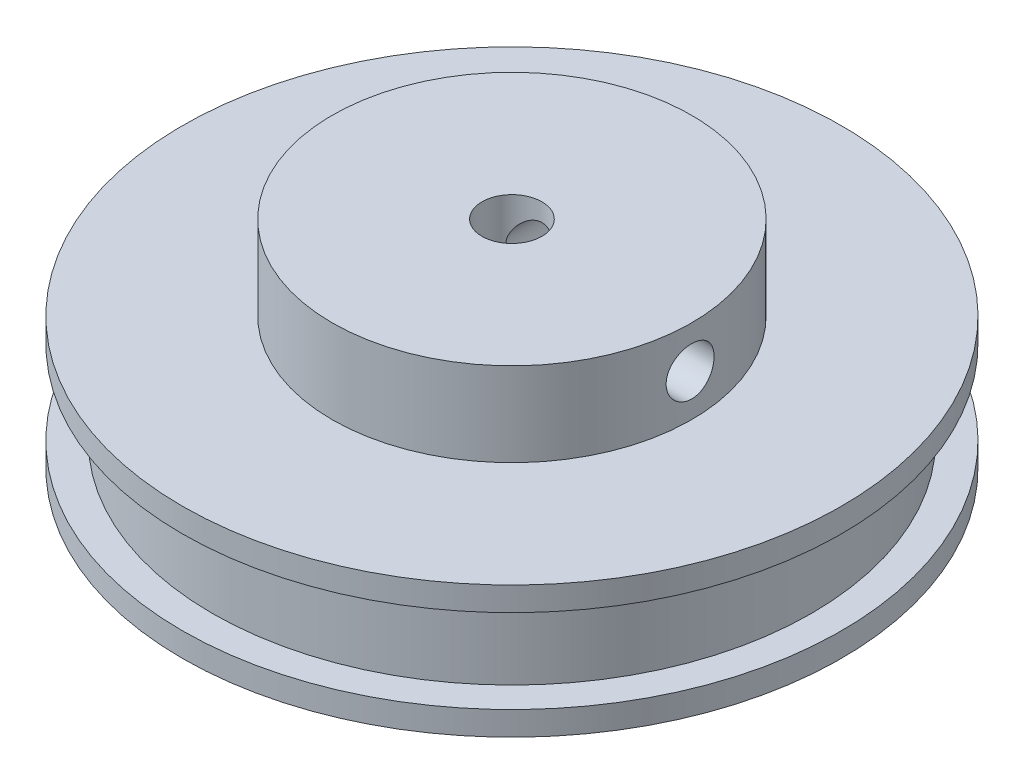
ISO-10303-21;
HEADER;
FILE_DESCRIPTION(('STEP AP214'),'2;1');
FILE_NAME('part.step','',(''),(''),'','','');
FILE_SCHEMA(('AUTOMOTIVE_DESIGN { 1 0 10303 214 1 1 1 1 }'));
ENDSEC;
DATA;
#1=APPLICATION_CONTEXT('core data for automotive mechanical design processes');
#2=APPLICATION_PROTOCOL_DEFINITION('international standard','automotive_design',2000,#1);
#3=PRODUCT_CONTEXT('',#1,'mechanical');
#4=PRODUCT('Part','Part','',(#3));
#5=PRODUCT_RELATED_PRODUCT_CATEGORY('part','',(#4));
#6=PRODUCT_DEFINITION_FORMATION('','',#4);
#7=PRODUCT_DEFINITION_CONTEXT('part definition',#1,'design');
#8=PRODUCT_DEFINITION('design','',#6,#7);
#9=PRODUCT_DEFINITION_SHAPE('','',#8);
#10=(LENGTH_UNIT() NAMED_UNIT(*) SI_UNIT(.MILLI.,.METRE.));
#11=(NAMED_UNIT(*) PLANE_ANGLE_UNIT() SI_UNIT($,.RADIAN.));
#12=(NAMED_UNIT(*) SI_UNIT($,.STERADIAN.) SOLID_ANGLE_UNIT());
#13=UNCERTAINTY_MEASURE_WITH_UNIT(LENGTH_MEASURE(1.E-05),#10,'distance_accuracy_value','');
#14=(GEOMETRIC_REPRESENTATION_CONTEXT(3) GLOBAL_UNCERTAINTY_ASSIGNED_CONTEXT((#13)) GLOBAL_UNIT_ASSIGNED_CONTEXT((#10,
#11,#12)) REPRESENTATION_CONTEXT('',''));
#15=CARTESIAN_POINT('',(0.,0.,0.));
#16=DIRECTION('',(0.,0.,1.));
#17=DIRECTION('',(1.,0.,0.));
#18=AXIS2_PLACEMENT_3D('',#15,#16,#17);
#19=CARTESIAN_POINT('',(0.,2.,0.));
#20=DIRECTION('',(0.,-1.,0.));
#21=DIRECTION('',(0.,0.,-1.));
#22=AXIS2_PLACEMENT_3D('',#19,#20,#21);
#23=CYLINDRICAL_SURFACE('',#22,27.5);
#24=CARTESIAN_POINT('',(0.,2.,0.));
#25=DIRECTION('',(0.,1.,0.));
#26=DIRECTION('',(0.,0.,1.));
#27=AXIS2_PLACEMENT_3D('',#24,#25,#26);
#28=CIRCLE('',#27,27.5);
#29=CARTESIAN_POINT('',(0.,2.,27.5));
#30=VERTEX_POINT('',#29);
#31=EDGE_CURVE('E136',#30,#30,#28,.T.);
#32=ORIENTED_EDGE('',*,*,#31,.F.);
#33=EDGE_LOOP('',(#32));
#34=FACE_BOUND('',#33,.T.);
#35=CARTESIAN_POINT('',(0.,0.,0.));
#36=DIRECTION('',(0.,1.,0.));
#37=DIRECTION('',(0.,0.,1.));
#38=AXIS2_PLACEMENT_3D('',#35,#36,#37);
#39=CIRCLE('',#38,27.5);
#40=CARTESIAN_POINT('',(0.,0.,27.5));
#41=VERTEX_POINT('',#40);
#42=EDGE_CURVE('E77',#41,#41,#39,.T.);
#43=ORIENTED_EDGE('',*,*,#42,.T.);
#44=EDGE_LOOP('',(#43));
#45=FACE_BOUND('',#44,.T.);
#46=ADVANCED_FACE('F38',(#34,#45),#23,.T.);
#47=CARTESIAN_POINT('',(0.,2.,0.));
#48=DIRECTION('',(0.,1.,0.));
#49=DIRECTION('',(0.,0.,1.));
#50=AXIS2_PLACEMENT_3D('',#47,#48,#49);
#51=PLANE('',#50);
#52=CARTESIAN_POINT('',(0.,2.,0.));
#53=DIRECTION('',(0.,1.,0.));
#54=DIRECTION('',(0.,0.,1.));
#55=AXIS2_PLACEMENT_3D('',#52,#53,#54);
#56=CIRCLE('',#55,25.);
#57=CARTESIAN_POINT('',(0.,2.,25.));
#58=VERTEX_POINT('',#57);
#59=EDGE_CURVE('E140',#58,#58,#56,.T.);
#60=ORIENTED_EDGE('',*,*,#59,.F.);
#61=EDGE_LOOP('',(#60));
#62=FACE_BOUND('',#61,.T.);
#63=ORIENTED_EDGE('',*,*,#31,.T.);
#64=EDGE_LOOP('',(#63));
#65=FACE_BOUND('',#64,.T.);
#66=ADVANCED_FACE('F120',(#62,#65),#51,.T.);
#67=CARTESIAN_POINT('',(0.,0.,0.));
#68=DIRECTION('',(0.,1.,0.));
#69=DIRECTION('',(0.,0.,1.));
#70=AXIS2_PLACEMENT_3D('',#67,#68,#69);
#71=PLANE('',#70);
#72=CARTESIAN_POINT('',(0.,0.,0.));
#73=DIRECTION('',(0.,1.,0.));
#74=DIRECTION('',(0.,0.,1.));
#75=AXIS2_PLACEMENT_3D('',#72,#73,#74);
#76=CIRCLE('',#75,2.5);
#77=CARTESIAN_POINT('',(0.,0.,2.5));
#78=VERTEX_POINT('',#77);
#79=EDGE_CURVE('E94',#78,#78,#76,.T.);
#80=ORIENTED_EDGE('',*,*,#79,.T.);
#81=EDGE_LOOP('',(#80));
#82=FACE_BOUND('',#81,.T.);
#83=ORIENTED_EDGE('',*,*,#42,.F.);
#84=EDGE_LOOP('',(#83));
#85=FACE_BOUND('',#84,.T.);
#86=ADVANCED_FACE('F118',(#82,#85),#71,.F.);
#87=CARTESIAN_POINT('',(0.,9.,0.));
#88=DIRECTION('',(0.,-1.,0.));
#89=DIRECTION('',(0.,0.,-1.));
#90=AXIS2_PLACEMENT_3D('',#87,#88,#89);
#91=CYLINDRICAL_SURFACE('',#90,25.);
#92=CARTESIAN_POINT('',(0.,9.,0.));
#93=DIRECTION('',(0.,1.,0.));
#94=DIRECTION('',(0.,0.,1.));
#95=AXIS2_PLACEMENT_3D('',#92,#93,#94);
#96=CIRCLE('',#95,25.);
#97=CARTESIAN_POINT('',(0.,9.,25.));
#98=VERTEX_POINT('',#97);
#99=EDGE_CURVE('E139',#98,#98,#96,.T.);
#100=ORIENTED_EDGE('',*,*,#99,.F.);
#101=EDGE_LOOP('',(#100));
#102=FACE_BOUND('',#101,.T.);
#103=ORIENTED_EDGE('',*,*,#59,.T.);
#104=EDGE_LOOP('',(#103));
#105=FACE_BOUND('',#104,.T.);
#106=ADVANCED_FACE('F114',(#102,#105),#91,.T.);
#107=CARTESIAN_POINT('',(0.,11.,0.));
#108=DIRECTION('',(0.,-1.,0.));
#109=DIRECTION('',(0.,0.,-1.));
#110=AXIS2_PLACEMENT_3D('',#107,#108,#109);
#111=CYLINDRICAL_SURFACE('',#110,27.5);
#112=CARTESIAN_POINT('',(0.,11.,0.));
#113=DIRECTION('',(0.,1.,0.));
#114=DIRECTION('',(0.,0.,1.));
#115=AXIS2_PLACEMENT_3D('',#112,#113,#114);
#116=CIRCLE('',#115,27.5);
#117=CARTESIAN_POINT('',(0.,11.,27.5));
#118=VERTEX_POINT('',#117);
#119=EDGE_CURVE('E142',#118,#118,#116,.T.);
#120=ORIENTED_EDGE('',*,*,#119,.F.);
#121=EDGE_LOOP('',(#120));
#122=FACE_BOUND('',#121,.T.);
#123=CARTESIAN_POINT('',(0.,9.,0.));
#124=DIRECTION('',(0.,1.,0.));
#125=DIRECTION('',(0.,0.,1.));
#126=AXIS2_PLACEMENT_3D('',#123,#124,#125);
#127=CIRCLE('',#126,27.5);
#128=CARTESIAN_POINT('',(0.,9.,27.5));
#129=VERTEX_POINT('',#128);
#130=EDGE_CURVE('E146',#129,#129,#127,.T.);
#131=ORIENTED_EDGE('',*,*,#130,.T.);
#132=EDGE_LOOP('',(#131));
#133=FACE_BOUND('',#132,.T.);
#134=ADVANCED_FACE('F107',(#122,#133),#111,.T.);
#135=CARTESIAN_POINT('',(0.,11.,0.));
#136=DIRECTION('',(0.,1.,0.));
#137=DIRECTION('',(0.,0.,1.));
#138=AXIS2_PLACEMENT_3D('',#135,#136,#137);
#139=PLANE('',#138);
#140=CARTESIAN_POINT('',(0.,11.,0.));
#141=DIRECTION('',(0.,1.,0.));
#142=DIRECTION('',(0.,0.,1.));
#143=AXIS2_PLACEMENT_3D('',#140,#141,#142);
#144=CIRCLE('',#143,15.);
#145=CARTESIAN_POINT('',(0.,11.,15.));
#146=VERTEX_POINT('',#145);
#147=EDGE_CURVE('E45',#146,#146,#144,.T.);
#148=ORIENTED_EDGE('',*,*,#147,.F.);
#149=EDGE_LOOP('',(#148));
#150=FACE_BOUND('',#149,.T.);
#151=ORIENTED_EDGE('',*,*,#119,.T.);
#152=EDGE_LOOP('',(#151));
#153=FACE_BOUND('',#152,.T.);
#154=ADVANCED_FACE('F103',(#150,#153),#139,.T.);
#155=CARTESIAN_POINT('',(0.,9.,0.));
#156=DIRECTION('',(0.,1.,0.));
#157=DIRECTION('',(0.,0.,1.));
#158=AXIS2_PLACEMENT_3D('',#155,#156,#157);
#159=PLANE('',#158);
#160=ORIENTED_EDGE('',*,*,#99,.T.);
#161=EDGE_LOOP('',(#160));
#162=FACE_BOUND('',#161,.T.);
#163=ORIENTED_EDGE('',*,*,#130,.F.);
#164=EDGE_LOOP('',(#163));
#165=FACE_BOUND('',#164,.T.);
#166=ADVANCED_FACE('F101',(#162,#165),#159,.F.);
#167=CARTESIAN_POINT('',(0.,18.,0.));
#168=DIRECTION('',(0.,-1.,0.));
#169=DIRECTION('',(0.,0.,-1.));
#170=AXIS2_PLACEMENT_3D('',#167,#168,#169);
#171=CYLINDRICAL_SURFACE('',#170,15.);
#172=CARTESIAN_POINT('',(14.8660687473185,14.5,2.00000000000005));
#173=CARTESIAN_POINT('',(14.8660704451043,14.6118038554675,1.99999528594764));
#174=CARTESIAN_POINT('',(14.8673436464034,14.7236760331162,1.99059326704133));
#175=CARTESIAN_POINT('',(14.8722964859732,14.9443024623359,1.95323796266135));
#176=CARTESIAN_POINT('',(14.8759785863295,15.0530534049172,1.92526569649118));
#177=CARTESIAN_POINT('',(14.8853249214529,15.2642113682263,1.85161311140269));
#178=CARTESIAN_POINT('',(14.8909877556206,15.3666228116177,1.8059453027505));
#179=CARTESIAN_POINT('',(14.9036558225185,15.5623110757096,1.69822564880692));
#180=CARTESIAN_POINT('',(14.9106608397868,15.655589358938,1.63617643263474));
#181=CARTESIAN_POINT('',(14.9252737732073,15.8309734546685,1.49703370489523));
#182=CARTESIAN_POINT('',(14.9328848849373,15.9130128656794,1.41985682274865));
#183=CARTESIAN_POINT('',(14.9478237625824,16.0630162454564,1.25282922872616));
#184=CARTESIAN_POINT('',(14.9551515139324,16.1309794914762,1.16297786647204));
#185=CARTESIAN_POINT('',(14.9687309976037,16.2511418417164,0.972731724927666));
#186=CARTESIAN_POINT('',(14.9749785650228,16.3032804892902,0.872298437711275));
#187=CARTESIAN_POINT('',(14.9856585341581,16.3899261641808,0.66400381603742));
#188=CARTESIAN_POINT('',(14.990091012146,16.4244339323777,0.556142793922454));
#189=CARTESIAN_POINT('',(14.9966188619561,16.4746389095803,0.336735375014143));
#190=CARTESIAN_POINT('',(14.9987279820508,16.490446815012,0.225214723469952));
#191=CARTESIAN_POINT('',(15.0004184797152,16.5031466087368,0.00108500230371052));
#192=CARTESIAN_POINT('',(14.9999999696283,16.5000393377365,-0.111524018722412));
#193=CARTESIAN_POINT('',(14.9966934411691,16.4750852694591,-0.333880124465715));
#194=CARTESIAN_POINT('',(14.9938211133781,16.4533575352544,-0.44364083736173));
#195=CARTESIAN_POINT('',(14.9859472409229,16.3919656729785,-0.6579441227125));
#196=CARTESIAN_POINT('',(14.9809456511403,16.3523011648319,-0.762486584541785));
#197=CARTESIAN_POINT('',(14.9693481900417,16.2560365588782,-0.963751808424073));
#198=CARTESIAN_POINT('',(14.9627475214588,16.1993853768169,-1.0604498493532));
#199=CARTESIAN_POINT('',(14.9486895041904,16.0707927427171,-1.24301169073473));
#200=CARTESIAN_POINT('',(14.9412321108429,15.9988504933722,-1.32887492586676));
#201=CARTESIAN_POINT('',(14.9262258809566,15.8410521516411,-1.48803006154533));
#202=CARTESIAN_POINT('',(14.918676784244,15.7550922318064,-1.56121903353016));
#203=CARTESIAN_POINT('',(14.9043949876924,15.5720540686274,-1.69214693057186));
#204=CARTESIAN_POINT('',(14.8976622910908,15.474975781197,-1.74988579436348));
#205=CARTESIAN_POINT('',(14.8857757633434,15.2723599996533,-1.84828286086495));
#206=CARTESIAN_POINT('',(14.8806227621479,15.1668180954815,-1.88893208906701));
#207=CARTESIAN_POINT('',(14.8724947546572,14.9503219793616,-1.95190090044919));
#208=CARTESIAN_POINT('',(14.8695196283616,14.8393680659734,-1.97422149354138));
#209=CARTESIAN_POINT('',(14.8661064501035,14.616108664995,-1.99976160768722));
#210=CARTESIAN_POINT('',(14.8656491151163,14.5038200696675,-2.00312631098807));
#211=CARTESIAN_POINT('',(14.867272242967,14.2802807438953,-1.99104288188791));
#212=CARTESIAN_POINT('',(14.8693526440475,14.1690299882606,-1.97559520729771));
#213=CARTESIAN_POINT('',(14.8757992043677,13.9511640135944,-1.92644805037015));
#214=CARTESIAN_POINT('',(14.8801564778765,13.8445325069819,-1.89281950323355));
#215=CARTESIAN_POINT('',(14.8906585901441,13.6384210865476,-1.8083384508012));
#216=CARTESIAN_POINT('',(14.8968034998284,13.5389414566763,-1.75748526209378));
#217=CARTESIAN_POINT('',(14.9102344661952,13.3493026895592,-1.63964406417206));
#218=CARTESIAN_POINT('',(14.9175271378913,13.2592029516318,-1.57256123166295));
#219=CARTESIAN_POINT('',(14.9324114351651,13.0914890615629,-1.42429832312794));
#220=CARTESIAN_POINT('',(14.9400030739993,13.013875463852,-1.34311762143749));
#221=CARTESIAN_POINT('',(14.9546894865533,12.8728234460789,-1.16832754835819));
#222=CARTESIAN_POINT('',(14.9617807004972,12.8094806836284,-1.07464064093247));
#223=CARTESIAN_POINT('',(14.974613414783,12.6994317178247,-0.87787245231757));
#224=CARTESIAN_POINT('',(14.9803549454849,12.6527251402439,-0.774791382513649));
#225=CARTESIAN_POINT('',(14.9898256469115,12.5774307384119,-0.562472772523383));
#226=CARTESIAN_POINT('',(14.9935608482078,12.5487885709165,-0.453254784247312));
#227=CARTESIAN_POINT('',(14.9986231668662,12.510259514539,-0.231506493423148));
#228=CARTESIAN_POINT('',(14.9999504085613,12.5003716572923,-0.118976362199773));
#229=CARTESIAN_POINT('',(15.0000464724842,12.4996517327597,0.105269873711638));
#230=CARTESIAN_POINT('',(14.9988350491343,12.5086725294056,0.21698552592193));
#231=CARTESIAN_POINT('',(14.9940293321986,12.545201041232,0.437297443052403));
#232=CARTESIAN_POINT('',(14.9904350419501,12.5727087305213,0.545893712341097));
#233=CARTESIAN_POINT('',(14.9812655664247,12.6453820470767,0.75685823458891));
#234=CARTESIAN_POINT('',(14.9756912840831,12.6905396264081,0.859229301543961));
#235=CARTESIAN_POINT('',(14.9631774939599,12.7972155496457,1.05496407863093));
#236=CARTESIAN_POINT('',(14.95623796097,12.8587341956524,1.14832762239922));
#237=CARTESIAN_POINT('',(14.9417029120984,12.9969266820036,1.32414728606679));
#238=CARTESIAN_POINT('',(14.9341029029987,13.0737097901392,1.40651715716405));
#239=CARTESIAN_POINT('',(14.919138648968,13.2400230690474,1.55725895587221));
#240=CARTESIAN_POINT('',(14.911774460102,13.3295562439213,1.62562757530237));
#241=CARTESIAN_POINT('',(14.8980810988492,13.5192839415709,1.746687909785));
#242=CARTESIAN_POINT('',(14.8917566176026,13.6195235915101,1.79930940429131));
#243=CARTESIAN_POINT('',(14.8809136658427,13.8274484675171,1.88689518281496));
#244=CARTESIAN_POINT('',(14.8763932602426,13.9351255697594,1.92187839666371));
#245=CARTESIAN_POINT('',(14.8707513382361,14.1194482787255,1.96495480378588));
#246=CARTESIAN_POINT('',(14.8690042861798,14.1949382729681,1.97807748135808));
#247=CARTESIAN_POINT('',(14.866662414787,14.3469415094705,1.99560165343187));
#248=CARTESIAN_POINT('',(14.8660675849485,14.4234547423974,2.00000322742325));
#249=CARTESIAN_POINT('',(14.8660687473185,14.5,2.00000000000005));
#250=B_SPLINE_CURVE_WITH_KNOTS('',3,(#172,#173,#174,#175,#176,#177,#178,#179,#180,#181,#182,
#183,#184,#185,#186,#187,#188,#189,#190,#191,#192,#193,#194,#195,#196,#197,#198,#199,#200,#201,
#202,#203,#204,#205,#206,#207,#208,#209,#210,#211,#212,#213,#214,#215,#216,#217,#218,#219,#220,
#221,#222,#223,#224,#225,#226,#227,#228,#229,#230,#231,#232,#233,#234,#235,#236,#237,#238,#239,
#240,#241,#242,#243,#244,#245,#246,#247,#248,#249),.UNSPECIFIED.,.T.,.F.,(4,2,2,2,2,2,2,2,2,2,2,
2,2,2,2,2,2,2,2,2,2,2,2,2,2,2,2,2,2,2,2,2,2,2,2,2,2,2,4),(0.,0.335131889250449,
0.670606846105682,1.00584506276825,1.34102950834956,1.67811595121165,2.01521969762238,
2.35359556525146,2.69195721256928,3.02830569524968,3.36463922864856,3.69883808669952,
4.03304402666678,4.36826528456251,4.70350402584628,5.04134915068958,5.3791956151909,
5.7172192765574,6.05522431149101,6.3906370258193,6.72604157783542,7.06014684818595,
7.39426537618209,7.73038528142332,8.06652010750621,8.40484511764504,8.74316251675152,
9.08045723770335,9.41773454222147,9.752397098563,10.0870591862064,10.4215688535019,
10.7560846978108,11.0930874236894,11.430169684094,11.768733419821,12.1069330231324,
12.3363794094425,12.5658237044201),.UNSPECIFIED.);
#251=CARTESIAN_POINT('',(14.8660687473185,14.5,2.00000000000005));
#252=VERTEX_POINT('',#251);
#253=EDGE_CURVE('E61',#252,#252,#250,.T.);
#254=ORIENTED_EDGE('',*,*,#253,.T.);
#255=EDGE_LOOP('',(#254));
#256=FACE_BOUND('',#255,.T.);
#257=CARTESIAN_POINT('',(0.,16.5,-15.));
#258=CARTESIAN_POINT('',(-0.111808835669284,16.4999952902931,-14.9999983574254));
#259=CARTESIAN_POINT('',(-0.22368597927628,16.4905924620375,-14.9987367072719));
#260=CARTESIAN_POINT('',(-0.444322725138079,16.4532336509504,-14.993825111269));
#261=CARTESIAN_POINT('',(-0.553079022333037,16.4252587051029,-14.9901727244172));
#262=CARTESIAN_POINT('',(-0.764248312626985,16.3515982824586,-14.9808907984907));
#263=CARTESIAN_POINT('',(-0.866665683058495,16.3059251889616,-14.9752626421097));
#264=CARTESIAN_POINT('',(-1.0623638950303,16.1981930861937,-14.9626538666039));
#265=CARTESIAN_POINT('',(-1.15564620633703,16.1361367188335,-14.9556734655857));
#266=CARTESIAN_POINT('',(-1.33102582250468,15.9969867383958,-14.9410899478996));
#267=CARTESIAN_POINT('',(-1.41305798549586,15.9198113549915,-14.9334835816211));
#268=CARTESIAN_POINT('',(-1.56304735673102,15.7527898109233,-14.9185313755795));
#269=CARTESIAN_POINT('',(-1.63100381997221,15.6629429800042,-14.9111855496234));
#270=CARTESIAN_POINT('',(-1.75115902268907,15.472700877055,-14.8975543544019));
#271=CARTESIAN_POINT('',(-1.80329607482578,15.3722663175214,-14.8912731776576));
#272=CARTESIAN_POINT('',(-1.8899384500729,15.1639689327632,-14.8805258737923));
#273=CARTESIAN_POINT('',(-1.92444453245278,15.0561064276467,-14.8760596685121));
#274=CARTESIAN_POINT('',(-1.97464606772174,14.8366941894983,-14.8694793656867));
#275=CARTESIAN_POINT('',(-1.99045204228506,14.7251701654671,-14.8673514537014));
#276=CARTESIAN_POINT('',(-2.00314680548117,14.501033820394,-14.8656465160931));
#277=CARTESIAN_POINT('',(-2.00003645633601,14.3884215491891,-14.866069374204));
#278=CARTESIAN_POINT('',(-1.97507745939234,14.1660788699721,-14.8694055577299));
#279=CARTESIAN_POINT('',(-1.95335097531762,14.0563344701143,-14.8723026462234));
#280=CARTESIAN_POINT('',(-1.89196724634371,13.8420631632399,-14.8802355277475));
#281=CARTESIAN_POINT('',(-1.85230959261457,13.737536375245,-14.8852713695413));
#282=CARTESIAN_POINT('',(-1.75605929143191,13.5362903652928,-14.8969326111103));
#283=CARTESIAN_POINT('',(-1.69941397913749,13.4395966288057,-14.903562941239));
#284=CARTESIAN_POINT('',(-1.57083393344289,13.2570409180823,-14.9176623621993));
#285=CARTESIAN_POINT('',(-1.49889840502385,13.1711795074458,-14.9251314966353));
#286=CARTESIAN_POINT('',(-1.34110490026362,13.0120169874181,-14.9401389923359));
#287=CARTESIAN_POINT('',(-1.25514170702645,12.9388201572977,-14.947677435412));
#288=CARTESIAN_POINT('',(-1.07209417013341,12.8078779550716,-14.9619192381826));
#289=CARTESIAN_POINT('',(-0.975009794442368,12.7501326274765,-14.9686225954715));
#290=CARTESIAN_POINT('',(-0.772392219730468,12.6517308823053,-14.9804439374358));
#291=CARTESIAN_POINT('',(-0.666855578841229,12.6110814689537,-14.9855612720896));
#292=CARTESIAN_POINT('',(-0.450370924336247,12.5481106810277,-14.9936282590407));
#293=CARTESIAN_POINT('',(-0.339423199542255,12.5257883293606,-14.9965780268993));
#294=CARTESIAN_POINT('',(-0.116166903325642,12.5002415672289,-14.9999624137686));
#295=CARTESIAN_POINT('',(-0.00387503454704105,12.4968735982165,-15.0004159384905));
#296=CARTESIAN_POINT('',(0.219671617218719,12.5089516641272,-14.9988079153852));
#297=CARTESIAN_POINT('',(0.330926425345666,12.5243972417824,-14.996746428686));
#298=CARTESIAN_POINT('',(0.548813715572939,12.573544653384,-14.990351753581));
#299=CARTESIAN_POINT('',(0.655462016512046,12.6071775683222,-14.9860271430292));
#300=CARTESIAN_POINT('',(0.86160509879356,12.6916729659371,-14.9755900925429));
#301=CARTESIAN_POINT('',(0.961099607015639,12.7425361060133,-14.9694775843944));
#302=CARTESIAN_POINT('',(1.15074887861608,12.8603921555833,-14.9560983737007));
#303=CARTESIAN_POINT('',(1.2408458143966,12.9274773657133,-14.9488251504572));
#304=CARTESIAN_POINT('',(1.4085529469919,13.0757433292243,-14.9339572870998));
#305=CARTESIAN_POINT('',(1.48616257662379,13.1569247225164,-14.9263626324062));
#306=CARTESIAN_POINT('',(1.62720549423098,13.3317131426396,-14.9116490247351));
#307=CARTESIAN_POINT('',(1.69054327608938,13.4253975667382,-14.904533487753));
#308=CARTESIAN_POINT('',(1.80058351078814,13.6221594102809,-14.8916413300182));
#309=CARTESIAN_POINT('',(1.84728633510347,13.7252366199104,-14.8858646793678));
#310=CARTESIAN_POINT('',(1.92257836500746,13.9375572420277,-14.8763281178008));
#311=CARTESIAN_POINT('',(1.95122028846796,14.0467816852108,-14.872562342326));
#312=CARTESIAN_POINT('',(1.98974667143959,14.2685436321288,-14.8674574869829));
#313=CARTESIAN_POINT('',(1.99963213426782,14.3810809583244,-14.8661182773134));
#314=CARTESIAN_POINT('',(2.00034485806189,14.6053234908535,-14.8660223129545));
#315=CARTESIAN_POINT('',(1.99132219194493,14.7170282409642,-14.8672452228252));
#316=CARTESIAN_POINT('',(1.95479376686689,14.9373178751039,-14.872091838742));
#317=CARTESIAN_POINT('',(1.92728801483269,15.045902760302,-14.8757155438883));
#318=CARTESIAN_POINT('',(1.85462310332207,15.2568436832516,-14.8849489027276));
#319=CARTESIAN_POINT('',(1.80947220819041,15.3592026111169,-14.890557626594));
#320=CARTESIAN_POINT('',(1.70281342759737,15.5549158838261,-14.9031304571282));
#321=CARTESIAN_POINT('',(1.64130522630428,15.648270054756,-14.910094589966));
#322=CARTESIAN_POINT('',(1.50312448509508,15.8240896499284,-14.9246596718306));
#323=CARTESIAN_POINT('',(1.42634027226901,15.9064669477551,-14.9322650575408));
#324=CARTESIAN_POINT('',(1.26002169349824,16.0572232163615,-14.9472171900166));
#325=CARTESIAN_POINT('',(1.17048434072978,16.1255988987503,-14.9545638756898));
#326=CARTESIAN_POINT('',(0.980752987852822,16.2466671384665,-14.9682063513753));
#327=CARTESIAN_POINT('',(0.880514620743964,16.2992906665552,-14.9744974642689));
#328=CARTESIAN_POINT('',(0.672592409587328,16.3868805985451,-14.9852732065897));
#329=CARTESIAN_POINT('',(0.564916678969889,16.4218659086249,-14.9897597692431));
#330=CARTESIAN_POINT('',(0.380588408098418,16.4649480063852,-14.9953572174327));
#331=CARTESIAN_POINT('',(0.305091081955778,16.4780732435236,-14.9970896363507));
#332=CARTESIAN_POINT('',(0.153073171616111,16.4956008141655,-14.9994115849077));
#333=CARTESIAN_POINT('',(0.0765525964512399,16.5000032246136,-15.000001124628));
#334=CARTESIAN_POINT('',(0.,16.5,-15.));
#335=B_SPLINE_CURVE_WITH_KNOTS('',3,(#257,#258,#259,#260,#261,#262,#263,#264,#265,#266,#267,
#268,#269,#270,#271,#272,#273,#274,#275,#276,#277,#278,#279,#280,#281,#282,#283,#284,#285,#286,
#287,#288,#289,#290,#291,#292,#293,#294,#295,#296,#297,#298,#299,#300,#301,#302,#303,#304,#305,
#306,#307,#308,#309,#310,#311,#312,#313,#314,#315,#316,#317,#318,#319,#320,#321,#322,#323,#324,
#325,#326,#327,#328,#329,#330,#331,#332,#333,#334),.UNSPECIFIED.,.T.,.F.,(4,2,2,2,2,2,2,2,2,2,2,
2,2,2,2,2,2,2,2,2,2,2,2,2,2,2,2,2,2,2,2,2,2,2,2,2,2,2,4),(0.,0.335146851305744,
0.670636430885045,1.00589169282741,1.34109292564035,1.67815978443559,2.01524447904836,
2.35362721511648,2.69199537766205,3.02835355914359,3.3646964092492,3.69884885098044,
4.03300891175851,4.36821583137898,4.70344018443797,5.04130544484849,5.37917167852296,
5.71717620202539,6.05516270391743,6.39058584992061,6.72600084354478,7.06015363396463,
7.39431917503546,7.73043274769884,8.06656158258761,8.4048770453545,8.74318495273048,
9.08050074735454,9.41779849783634,9.75242927496624,10.0870599266874,10.4215340370262,
10.756014605959,11.0930366783511,11.4301378125116,11.7686952667452,12.1068890499242,
12.3363573904731,12.5658237068544),.UNSPECIFIED.);
#336=CARTESIAN_POINT('',(0.,16.5,-15.));
#337=VERTEX_POINT('',#336);
#338=EDGE_CURVE('E65',#337,#337,#335,.T.);
#339=ORIENTED_EDGE('',*,*,#338,.T.);
#340=EDGE_LOOP('',(#339));
#341=FACE_BOUND('',#340,.T.);
#342=CARTESIAN_POINT('',(0.,18.,0.));
#343=DIRECTION('',(0.,1.,0.));
#344=DIRECTION('',(0.,0.,1.));
#345=AXIS2_PLACEMENT_3D('',#342,#343,#344);
#346=CIRCLE('',#345,15.);
#347=CARTESIAN_POINT('',(0.,18.,15.));
#348=VERTEX_POINT('',#347);
#349=EDGE_CURVE('E158',#348,#348,#346,.T.);
#350=ORIENTED_EDGE('',*,*,#349,.F.);
#351=EDGE_LOOP('',(#350));
#352=FACE_BOUND('',#351,.T.);
#353=ORIENTED_EDGE('',*,*,#147,.T.);
#354=EDGE_LOOP('',(#353));
#355=FACE_BOUND('',#354,.T.);
#356=ADVANCED_FACE('F96',(#256,#341,#352,#355),#171,.T.);
#357=CARTESIAN_POINT('',(0.,18.,0.));
#358=DIRECTION('',(0.,1.,0.));
#359=DIRECTION('',(0.,0.,1.));
#360=AXIS2_PLACEMENT_3D('',#357,#358,#359);
#361=PLANE('',#360);
#362=CARTESIAN_POINT('',(0.,18.,0.));
#363=DIRECTION('',(0.,1.,0.));
#364=DIRECTION('',(0.,0.,1.));
#365=AXIS2_PLACEMENT_3D('',#362,#363,#364);
#366=CIRCLE('',#365,2.5);
#367=CARTESIAN_POINT('',(0.,18.,2.5));
#368=VERTEX_POINT('',#367);
#369=EDGE_CURVE('E67',#368,#368,#366,.T.);
#370=ORIENTED_EDGE('',*,*,#369,.F.);
#371=EDGE_LOOP('',(#370));
#372=FACE_BOUND('',#371,.T.);
#373=ORIENTED_EDGE('',*,*,#349,.T.);
#374=EDGE_LOOP('',(#373));
#375=FACE_BOUND('',#374,.T.);
#376=ADVANCED_FACE('F100',(#372,#375),#361,.T.);
#377=CARTESIAN_POINT('',(0.,0.,0.));
#378=DIRECTION('',(0.,1.,0.));
#379=DIRECTION('',(0.,0.,1.));
#380=AXIS2_PLACEMENT_3D('',#377,#378,#379);
#381=CYLINDRICAL_SURFACE('',#380,2.5);
#382=CARTESIAN_POINT('',(2.,14.5,-1.5));
#383=CARTESIAN_POINT('',(1.9999899563842,14.4249189826114,-1.5000227575991));
#384=CARTESIAN_POINT('',(1.99572243014959,14.3497210739064,-1.50575588676017));
#385=CARTESIAN_POINT('',(1.97904350434638,14.2016854705704,-1.52759797098302));
#386=CARTESIAN_POINT('',(1.96660415938922,14.1288567781879,-1.54374252679463));
#387=CARTESIAN_POINT('',(1.9288828901246,13.9623945804915,-1.59078313764401));
#388=CARTESIAN_POINT('',(1.90063587852784,13.8703574929005,-1.62485949442395));
#389=CARTESIAN_POINT('',(1.83286412912235,13.6940318598387,-1.70094533012843));
#390=CARTESIAN_POINT('',(1.79330760683741,13.6097660503329,-1.74297705283045));
#391=CARTESIAN_POINT('',(1.68777756612173,13.4196603432195,-1.84624966659378));
#392=CARTESIAN_POINT('',(1.61742363711761,13.3170334258727,-1.90894188114929));
#393=CARTESIAN_POINT('',(1.4586193506474,13.1260231647878,-2.03287996747903));
#394=CARTESIAN_POINT('',(1.37018407682201,13.0376280578861,-2.0941269976447));
#395=CARTESIAN_POINT('',(1.19476026278806,12.8928950804225,-2.1979067439451));
#396=CARTESIAN_POINT('',(1.11093376146689,12.8336737173159,-2.24174680788007));
#397=CARTESIAN_POINT('',(0.932444755507564,12.7276340400337,-2.32165152523267));
#398=CARTESIAN_POINT('',(0.837799422094952,12.6807964517991,-2.35772824500368));
#399=CARTESIAN_POINT('',(0.655317082222549,12.6082870394193,-2.41415644696378));
#400=CARTESIAN_POINT('',(0.568853585755696,12.5804174354239,-2.43610736091393));
#401=CARTESIAN_POINT('',(0.391188052921992,12.536501304746,-2.47085912284979));
#402=CARTESIAN_POINT('',(0.299988637312623,12.52044831209,-2.48366497483986));
#403=CARTESIAN_POINT('',(0.115048335136528,12.5011419067099,-2.49907968883617));
#404=CARTESIAN_POINT('',(0.0212997713727013,12.4979328073114,-2.50165324772141));
#405=CARTESIAN_POINT('',(-0.165416366428141,12.5046642348722,-2.49626936144757));
#406=CARTESIAN_POINT('',(-0.258383904122233,12.5146053703685,-2.48831142893578));
#407=CARTESIAN_POINT('',(-0.435683568436098,12.546067986313,-2.4632836571348));
#408=CARTESIAN_POINT('',(-0.520210188917499,12.5669288169561,-2.44673404857181));
#409=CARTESIAN_POINT('',(-0.684171862172426,12.6186952342522,-2.40604493660584));
#410=CARTESIAN_POINT('',(-0.76360562412977,12.6496033554976,-2.38190351809567));
#411=CARTESIAN_POINT('',(-0.923527318234433,12.7236006985885,-2.32486221996811));
#412=CARTESIAN_POINT('',(-1.00337969293305,12.7675765160147,-2.29134265660255));
#413=CARTESIAN_POINT('',(-1.15470891362336,12.8645378595917,-2.21894043646479));
#414=CARTESIAN_POINT('',(-1.22618103296473,12.9175284293631,-2.18005477975512));
#415=CARTESIAN_POINT('',(-1.37426521356107,13.0430618687988,-2.09053510980241));
#416=CARTESIAN_POINT('',(-1.44890108738507,13.1173836142049,-2.03913144290366));
#417=CARTESIAN_POINT('',(-1.58538384993671,13.2762559036507,-1.9349237792571));
#418=CARTESIAN_POINT('',(-1.6472149443604,13.3608188786743,-1.88211814269102));
#419=CARTESIAN_POINT('',(-1.75228528490804,13.5312201958179,-1.78441317626436));
#420=CARTESIAN_POINT('',(-1.79674173995946,13.6161509405137,-1.73924224553799));
#421=CARTESIAN_POINT('',(-1.87389106987978,13.7943664663345,-1.65582105773209));
#422=CARTESIAN_POINT('',(-1.90660965872838,13.8876324203376,-1.61755576516689));
#423=CARTESIAN_POINT('',(-1.95062199735974,14.0527916040278,-1.56393805143324));
#424=CARTESIAN_POINT('',(-1.96540293714784,14.1226128308979,-1.54515601955456));
#425=CARTESIAN_POINT('',(-1.98746978122375,14.2651802059542,-1.51667304681101));
#426=CARTESIAN_POINT('',(-1.99477239579985,14.3379194539107,-1.50695186390373));
#427=CARTESIAN_POINT('',(-2.0012999442642,14.4848633779274,-1.49827790293909));
#428=CARTESIAN_POINT('',(-2.00047806264257,14.5590740850574,-1.49938753445573));
#429=CARTESIAN_POINT('',(-1.99072610261057,14.7060473250374,-1.51230456185753));
#430=CARTESIAN_POINT('',(-1.98178458332099,14.7788076663875,-1.52412705251965));
#431=CARTESIAN_POINT('',(-1.95331430449204,14.9390632026618,-1.56051508430773));
#432=CARTESIAN_POINT('',(-1.9316709289088,15.0255982681308,-1.58755721486228));
#433=CARTESIAN_POINT('',(-1.87841388450525,15.1922908660855,-1.65022809339808));
#434=CARTESIAN_POINT('',(-1.84677049067316,15.2724284809031,-1.6858823654909));
#435=CARTESIAN_POINT('',(-1.75807608919816,15.4615289293493,-1.77903249993889));
#436=CARTESIAN_POINT('',(-1.69602510944931,15.5668953343252,-1.83905564347523));
#437=CARTESIAN_POINT('',(-1.55438039564658,15.764384149242,-1.96026853157683));
#438=CARTESIAN_POINT('',(-1.47476601547363,15.8564907596835,-2.02145957104429));
#439=CARTESIAN_POINT('',(-1.29702304107542,16.027462807345,-2.13993299259157));
#440=CARTESIAN_POINT('',(-1.19864860522964,16.1061226291131,-2.1971478825966));
#441=CARTESIAN_POINT('',(-0.984970277741333,16.2452665274442,-2.30083046289374));
#442=CARTESIAN_POINT('',(-0.869723203455205,16.3058096056706,-2.3473329244064));
#443=CARTESIAN_POINT('',(-0.664531994140986,16.3884905874669,-2.41163161860482));
#444=CARTESIAN_POINT('',(-0.578408265123348,16.4167173769741,-2.43384921549885));
#445=CARTESIAN_POINT('',(-0.401365381235645,16.461432134964,-2.46921550391513));
#446=CARTESIAN_POINT('',(-0.310449944179072,16.4779290645406,-2.48237111815072));
#447=CARTESIAN_POINT('',(-0.125961358052316,16.4981928241047,-2.49854699723994));
#448=CARTESIAN_POINT('',(-0.0323797561454615,16.5019132050583,-2.50153028039159));
#449=CARTESIAN_POINT('',(0.154129494971543,16.4962334907348,-2.49698719993361));
#450=CARTESIAN_POINT('',(0.247057097671178,16.4868324715917,-2.48946009629711));
#451=CARTESIAN_POINT('',(0.424484983307836,16.4563964529088,-2.46524008405095));
#452=CARTESIAN_POINT('',(0.509170159101607,16.4360106685972,-2.44905900306101));
#453=CARTESIAN_POINT('',(0.673520542356737,16.3851465786865,-2.40905201963011));
#454=CARTESIAN_POINT('',(0.753184443303519,16.354665659174,-2.3852241372675));
#455=CARTESIAN_POINT('',(0.913383591851862,16.2816254556074,-2.32886203207214));
#456=CARTESIAN_POINT('',(0.993310088153965,16.238206157889,-2.29572397002092));
#457=CARTESIAN_POINT('',(1.14486396126305,16.1423576629054,-2.22403396009593));
#458=CARTESIAN_POINT('',(1.21648689776308,16.0899236819315,-2.18547913977516));
#459=CARTESIAN_POINT('',(1.36488223995397,15.9657037869963,-2.0966685242987));
#460=CARTESIAN_POINT('',(1.4397080379364,15.8921535866846,-2.04563299169993));
#461=CARTESIAN_POINT('',(1.5766935307999,15.7348830744766,-1.9420131292006));
#462=CARTESIAN_POINT('',(1.63883728583053,15.6511501723947,-1.88942694411834));
#463=CARTESIAN_POINT('',(1.7455126136634,15.4810424554704,-1.79109125321811));
#464=CARTESIAN_POINT('',(1.79106140064658,15.3954274787839,-1.74513263017548));
#465=CARTESIAN_POINT('',(1.87016304685231,15.2156081117486,-1.66007449903139));
#466=CARTESIAN_POINT('',(1.90373836359645,15.1214202219623,-1.62096222081731));
#467=CARTESIAN_POINT('',(1.94914139922438,14.9538606732473,-1.56580101941138));
#468=CARTESIAN_POINT('',(1.96446470848963,14.8825804555928,-1.54635220628734));
#469=CARTESIAN_POINT('',(1.98726282623961,14.7369757290291,-1.51695472225641));
#470=CARTESIAN_POINT('',(1.99476751139893,14.6626639447221,-1.50696990066826));
#471=CARTESIAN_POINT('',(1.99935742227831,14.5586747856577,-1.50085460132402));
#472=CARTESIAN_POINT('',(2.00000392566845,14.5293463217565,-1.49999110491774));
#473=CARTESIAN_POINT('',(2.,14.5,-1.5));
#474=B_SPLINE_CURVE_WITH_KNOTS('',3,(#382,#383,#384,#385,#386,#387,#388,#389,#390,#391,#392,
#393,#394,#395,#396,#397,#398,#399,#400,#401,#402,#403,#404,#405,#406,#407,#408,#409,#410,#411,
#412,#413,#414,#415,#416,#417,#418,#419,#420,#421,#422,#423,#424,#425,#426,#427,#428,#429,#430,
#431,#432,#433,#434,#435,#436,#437,#438,#439,#440,#441,#442,#443,#444,#445,#446,#447,#448,#449,
#450,#451,#452,#453,#454,#455,#456,#457,#458,#459,#460,#461,#462,#463,#464,#465,#466,#467,#468,
#469,#470,#471,#472,#473),.UNSPECIFIED.,.T.,.F.,(4,2,2,2,2,2,2,2,2,2,2,2,2,2,2,2,2,2,2,2,2,2,2,
2,2,2,2,2,2,2,2,2,2,2,2,2,2,2,2,2,2,2,2,2,2,4),(0.,0.225140818813289,0.451055593895016,
0.755714384660878,1.06123795594964,1.47720804611674,1.89283253536879,2.22639303179097,
2.55943127851024,2.83862094435178,3.11765772560939,3.39765639927928,3.67766803055209,
3.94241917501297,4.20723715914625,4.49756510688428,4.78805602626152,5.13841226546404,
5.48919811771067,5.80619193384967,6.12248701337037,6.34307726284837,6.56317352160417,
6.78453876949455,7.00621641426758,7.28428560377194,7.56318925297413,7.96975811975666,
8.37680748728569,8.78961174948152,9.20105660259843,9.4798592761315,9.75844872724252,
10.0380499218877,10.3176708039936,10.5823344198312,10.8470666181456,11.1364335884202,
11.4259545900794,11.7747351905783,12.1239515037794,12.4449574092071,12.7653580273015,
12.9909138326702,13.2156045429056,13.3036035490356),.UNSPECIFIED.);
#475=CARTESIAN_POINT('',(1.76776695296638,13.5645856533065,-1.76776695296636));
#476=VERTEX_POINT('',#475);
#477=CARTESIAN_POINT('',(1.76776695296637,15.4354143466935,-1.76776695296636));
#478=VERTEX_POINT('',#477);
#479=EDGE_CURVE('E60',#476,#478,#474,.T.);
#480=ORIENTED_EDGE('',*,*,#479,.T.);
#481=CARTESIAN_POINT('',(1.49999999999999,14.5,2.00000000000001));
#482=CARTESIAN_POINT('',(1.5000227575991,14.4249189826114,1.9999899563842));
#483=CARTESIAN_POINT('',(1.50575588676016,14.3497210739064,1.99572243014959));
#484=CARTESIAN_POINT('',(1.52759797098301,14.2016854705704,1.97904350434639));
#485=CARTESIAN_POINT('',(1.54374252679463,14.1288567781879,1.96660415938923));
#486=CARTESIAN_POINT('',(1.590783137644,13.9623945804915,1.9288828901246));
#487=CARTESIAN_POINT('',(1.62485949442394,13.8703574929005,1.90063587852784));
#488=CARTESIAN_POINT('',(1.70094533012842,13.6940318598387,1.83286412912235));
#489=CARTESIAN_POINT('',(1.74297705283045,13.6097660503329,1.79330760683741));
#490=CARTESIAN_POINT('',(1.84624966659378,13.4196603432195,1.68777756612173));
#491=CARTESIAN_POINT('',(1.90894188114929,13.3170334258727,1.61742363711761));
#492=CARTESIAN_POINT('',(2.03287996747903,13.1260231647878,1.4586193506474));
#493=CARTESIAN_POINT('',(2.0941269976447,13.0376280578861,1.37018407682201));
#494=CARTESIAN_POINT('',(2.1979067439451,12.8928950804225,1.19476026278807));
#495=CARTESIAN_POINT('',(2.24174680788007,12.8336737173159,1.1109337614669));
#496=CARTESIAN_POINT('',(2.32165152523267,12.7276340400337,0.932444755507568));
#497=CARTESIAN_POINT('',(2.35772824500367,12.6807964517991,0.837799422094956));
#498=CARTESIAN_POINT('',(2.41415644696378,12.6082870394193,0.655317082222554));
#499=CARTESIAN_POINT('',(2.43610736091393,12.5804174354239,0.5688535857557));
#500=CARTESIAN_POINT('',(2.47085912284979,12.536501304746,0.391188052921996));
#501=CARTESIAN_POINT('',(2.48366497483986,12.52044831209,0.299988637312628));
#502=CARTESIAN_POINT('',(2.49907968883617,12.5011419067099,0.115048335136534));
#503=CARTESIAN_POINT('',(2.50165324772141,12.4979328073114,0.0212997713727076));
#504=CARTESIAN_POINT('',(2.49626936144757,12.5046642348722,-0.165416366428134));
#505=CARTESIAN_POINT('',(2.48831142893578,12.5146053703685,-0.258383904122225));
#506=CARTESIAN_POINT('',(2.4632836571348,12.546067986313,-0.43568356843609));
#507=CARTESIAN_POINT('',(2.44673404857181,12.5669288169561,-0.520210188917491));
#508=CARTESIAN_POINT('',(2.40604493660584,12.6186952342522,-0.684171862172418));
#509=CARTESIAN_POINT('',(2.38190351809567,12.6496033554976,-0.763605624129762));
#510=CARTESIAN_POINT('',(2.32486221996811,12.7236006985885,-0.923527318234425));
#511=CARTESIAN_POINT('',(2.29134265660256,12.7675765160147,-1.00337969293304));
#512=CARTESIAN_POINT('',(2.2189404364648,12.8645378595917,-1.15470891362335));
#513=CARTESIAN_POINT('',(2.18005477975512,12.9175284293631,-1.22618103296472));
#514=CARTESIAN_POINT('',(2.09053510980242,13.0430618687988,-1.37426521356106));
#515=CARTESIAN_POINT('',(2.03913144290367,13.1173836142049,-1.44890108738506));
#516=CARTESIAN_POINT('',(1.93492377925711,13.2762559036507,-1.58538384993671));
#517=CARTESIAN_POINT('',(1.88211814269103,13.3608188786743,-1.6472149443604));
#518=CARTESIAN_POINT('',(1.78441317626437,13.5312201958179,-1.75228528490804));
#519=CARTESIAN_POINT('',(1.739242245538,13.6161509405137,-1.79674173995945));
#520=CARTESIAN_POINT('',(1.65582105773209,13.7943664663345,-1.87389106987978));
#521=CARTESIAN_POINT('',(1.6175557651669,13.8876324203376,-1.90660965872837));
#522=CARTESIAN_POINT('',(1.56393805143325,14.0527916040278,-1.95062199735974));
#523=CARTESIAN_POINT('',(1.54515601955457,14.1226128308979,-1.96540293714783));
#524=CARTESIAN_POINT('',(1.51667304681102,14.2651802059542,-1.98746978122375));
#525=CARTESIAN_POINT('',(1.50695186390374,14.3379194539107,-1.99477239579984));
#526=CARTESIAN_POINT('',(1.4982779029391,14.4848633779274,-2.0012999442642));
#527=CARTESIAN_POINT('',(1.49938753445574,14.5590740850574,-2.00047806264257));
#528=CARTESIAN_POINT('',(1.51230456185753,14.7060473250374,-1.99072610261057));
#529=CARTESIAN_POINT('',(1.52412705251966,14.7788076663875,-1.98178458332098));
#530=CARTESIAN_POINT('',(1.56051508430774,14.9390632026618,-1.95331430449203));
#531=CARTESIAN_POINT('',(1.58755721486229,15.0255982681308,-1.9316709289088));
#532=CARTESIAN_POINT('',(1.65022809339808,15.1922908660855,-1.87841388450525));
#533=CARTESIAN_POINT('',(1.6858823654909,15.2724284809031,-1.84677049067316));
#534=CARTESIAN_POINT('',(1.7790324999389,15.4615289293493,-1.75807608919815));
#535=CARTESIAN_POINT('',(1.83905564347524,15.5668953343252,-1.6960251094493));
#536=CARTESIAN_POINT('',(1.96026853157684,15.764384149242,-1.55438039564657));
#537=CARTESIAN_POINT('',(2.0214595710443,15.8564907596835,-1.47476601547361));
#538=CARTESIAN_POINT('',(2.13993299259158,16.027462807345,-1.29702304107541));
#539=CARTESIAN_POINT('',(2.19714788259661,16.1061226291131,-1.19864860522963));
#540=CARTESIAN_POINT('',(2.30083046289375,16.2452665274442,-0.984970277741318));
#541=CARTESIAN_POINT('',(2.34733292440641,16.3058096056706,-0.86972320345519));
#542=CARTESIAN_POINT('',(2.41163161860483,16.3884905874669,-0.664531994140972));
#543=CARTESIAN_POINT('',(2.43384921549886,16.4167173769741,-0.578408265123334));
#544=CARTESIAN_POINT('',(2.46921550391513,16.461432134964,-0.401365381235631));
#545=CARTESIAN_POINT('',(2.48237111815073,16.4779290645406,-0.310449944179059));
#546=CARTESIAN_POINT('',(2.49854699723995,16.4981928241047,-0.125961358052302));
#547=CARTESIAN_POINT('',(2.50153028039159,16.5019132050583,-0.0323797561454474));
#548=CARTESIAN_POINT('',(2.4969871999336,16.4962334907348,0.154129494971556));
#549=CARTESIAN_POINT('',(2.48946009629711,16.4868324715917,0.247057097671191));
#550=CARTESIAN_POINT('',(2.46524008405095,16.4563964529088,0.424484983307848));
#551=CARTESIAN_POINT('',(2.449059003061,16.4360106685972,0.509170159101619));
#552=CARTESIAN_POINT('',(2.4090520196301,16.3851465786865,0.673520542356749));
#553=CARTESIAN_POINT('',(2.38522413726749,16.354665659174,0.753184443303531));
#554=CARTESIAN_POINT('',(2.32886203207213,16.2816254556074,0.913383591851871));
#555=CARTESIAN_POINT('',(2.29572397002092,16.238206157889,0.993310088153974));
#556=CARTESIAN_POINT('',(2.22403396009593,16.1423576629054,1.14486396126305));
#557=CARTESIAN_POINT('',(2.18547913977516,16.0899236819315,1.21648689776308));
#558=CARTESIAN_POINT('',(2.0966685242987,15.9657037869963,1.36488223995398));
#559=CARTESIAN_POINT('',(2.04563299169992,15.8921535866846,1.43970803793641));
#560=CARTESIAN_POINT('',(1.94201312920059,15.7348830744766,1.57669353079991));
#561=CARTESIAN_POINT('',(1.88942694411833,15.6511501723947,1.63883728583054));
#562=CARTESIAN_POINT('',(1.79109125321811,15.4810424554704,1.74551261366341));
#563=CARTESIAN_POINT('',(1.74513263017547,15.3954274787839,1.79106140064659));
#564=CARTESIAN_POINT('',(1.66007449903138,15.2156081117486,1.87016304685231));
#565=CARTESIAN_POINT('',(1.6209622208173,15.1214202219623,1.90373836359645));
#566=CARTESIAN_POINT('',(1.56580101941137,14.9538606732473,1.94914139922439));
#567=CARTESIAN_POINT('',(1.54635220628733,14.8825804555928,1.96446470848964));
#568=CARTESIAN_POINT('',(1.5169547222564,14.7369757290291,1.98726282623962));
#569=CARTESIAN_POINT('',(1.50696990066825,14.6626639447221,1.99476751139894));
#570=CARTESIAN_POINT('',(1.50085460132401,14.5586747856577,1.99935742227831));
#571=CARTESIAN_POINT('',(1.49999110491774,14.5293463217565,2.00000392566845));
#572=CARTESIAN_POINT('',(1.49999999999999,14.5,2.00000000000001));
#573=B_SPLINE_CURVE_WITH_KNOTS('',3,(#481,#482,#483,#484,#485,#486,#487,#488,#489,#490,#491,
#492,#493,#494,#495,#496,#497,#498,#499,#500,#501,#502,#503,#504,#505,#506,#507,#508,#509,#510,
#511,#512,#513,#514,#515,#516,#517,#518,#519,#520,#521,#522,#523,#524,#525,#526,#527,#528,#529,
#530,#531,#532,#533,#534,#535,#536,#537,#538,#539,#540,#541,#542,#543,#544,#545,#546,#547,#548,
#549,#550,#551,#552,#553,#554,#555,#556,#557,#558,#559,#560,#561,#562,#563,#564,#565,#566,#567,
#568,#569,#570,#571,#572),.UNSPECIFIED.,.T.,.F.,(4,2,2,2,2,2,2,2,2,2,2,2,2,2,2,2,2,2,2,2,2,2,2,
2,2,2,2,2,2,2,2,2,2,2,2,2,2,2,2,2,2,2,2,2,2,4),(0.,0.225140818813293,0.451055593895018,
0.75571438466088,1.06123795594964,1.47720804611674,1.8928325353688,2.22639303179098,
2.55943127851025,2.83862094435178,3.11765772560939,3.39765639927928,3.67766803055209,
3.94241917501297,4.20723715914625,4.49756510688428,4.78805602626152,5.13841226546404,
5.48919811771067,5.80619193384967,6.12248701337037,6.34307726284837,6.56317352160417,
6.78453876949455,7.00621641426759,7.28428560377194,7.56318925297414,7.96975811975666,
8.37680748728571,8.78961174948153,9.20105660259844,9.47985927613151,9.75844872724252,
10.0380499218877,10.3176708039936,10.5823344198312,10.8470666181456,11.1364335884202,
11.4259545900794,11.7747351905783,12.1239515037794,12.4449574092071,12.7653580273015,
12.9909138326702,13.2156045429056,13.3036035490356),.UNSPECIFIED.);
#574=EDGE_CURVE('E51',#478,#476,#573,.T.);
#575=ORIENTED_EDGE('',*,*,#574,.T.);
#576=EDGE_LOOP('',(#480,#575));
#577=FACE_BOUND('',#576,.T.);
#578=ORIENTED_EDGE('',*,*,#79,.F.);
#579=EDGE_LOOP('',(#578));
#580=FACE_BOUND('',#579,.T.);
#581=ORIENTED_EDGE('',*,*,#369,.T.);
#582=EDGE_LOOP('',(#581));
#583=FACE_BOUND('',#582,.T.);
#584=ADVANCED_FACE('F58',(#577,#580,#583),#381,.F.);
#585=CARTESIAN_POINT('',(0.,14.5,-27.5));
#586=DIRECTION('',(0.,0.,1.));
#587=DIRECTION('',(1.,0.,0.));
#588=AXIS2_PLACEMENT_3D('',#585,#586,#587);
#589=CYLINDRICAL_SURFACE('',#588,2.);
#590=ORIENTED_EDGE('',*,*,#479,.F.);
#591=CARTESIAN_POINT('',(0.,14.5,0.));
#592=DIRECTION('',(0.707106781186546,0.,0.707106781186549));
#593=DIRECTION('',(-0.707106781186549,0.,0.707106781186546));
#594=AXIS2_PLACEMENT_3D('',#591,#592,#593);
#595=ELLIPSE('',#594,2.82842712474619,2.);
#596=EDGE_CURVE('E11',#476,#478,#595,.T.);
#597=ORIENTED_EDGE('',*,*,#596,.T.);
#598=EDGE_LOOP('',(#590,#597));
#599=FACE_BOUND('',#598,.T.);
#600=ORIENTED_EDGE('',*,*,#338,.F.);
#601=EDGE_LOOP('',(#600));
#602=FACE_BOUND('',#601,.T.);
#603=ADVANCED_FACE('F63',(#599,#602),#589,.F.);
#604=CARTESIAN_POINT('',(27.5000000000001,14.5,0.));
#605=DIRECTION('',(-1.,0.,0.));
#606=DIRECTION('',(0.,0.,1.));
#607=AXIS2_PLACEMENT_3D('',#604,#605,#606);
#608=CYLINDRICAL_SURFACE('',#607,2.);
#609=ORIENTED_EDGE('',*,*,#596,.F.);
#610=ORIENTED_EDGE('',*,*,#574,.F.);
#611=EDGE_LOOP('',(#609,#610));
#612=FACE_BOUND('',#611,.T.);
#613=ORIENTED_EDGE('',*,*,#253,.F.);
#614=EDGE_LOOP('',(#613));
#615=FACE_BOUND('',#614,.T.);
#616=ADVANCED_FACE('F52',(#612,#615),#608,.F.);
#617=CLOSED_SHELL('',(#46,#66,#86,#106,#134,#154,#166,#356,#376,#584,#603,#616));
#618=MANIFOLD_SOLID_BREP('B2',#617);
#619=ADVANCED_BREP_SHAPE_REPRESENTATION('',(#18,#618),#14);
#620=SHAPE_DEFINITION_REPRESENTATION(#9,#619);
ENDSEC;
END-ISO-10303-21;
